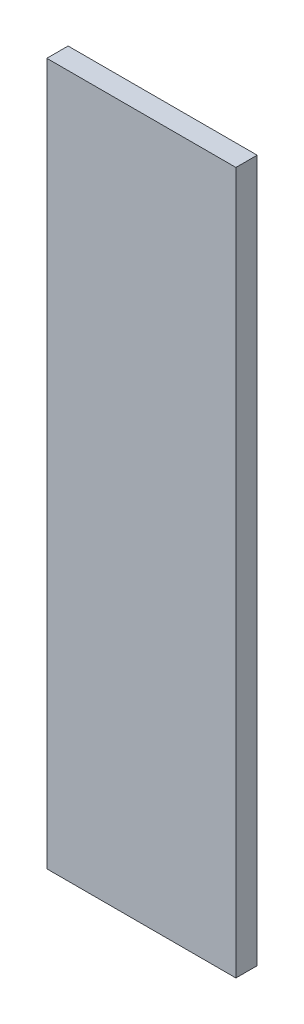
ISO-10303-21;
HEADER;
FILE_DESCRIPTION(('STEP AP214'),'2;1');
FILE_NAME('part.step','',(''),(''),'','','');
FILE_SCHEMA(('AUTOMOTIVE_DESIGN { 1 0 10303 214 1 1 1 1 }'));
ENDSEC;
DATA;
#1=APPLICATION_CONTEXT('core data for automotive mechanical design processes');
#2=APPLICATION_PROTOCOL_DEFINITION('international standard','automotive_design',2000,#1);
#3=PRODUCT_CONTEXT('',#1,'mechanical');
#4=PRODUCT('Part','Part','',(#3));
#5=PRODUCT_RELATED_PRODUCT_CATEGORY('part','',(#4));
#6=PRODUCT_DEFINITION_FORMATION('','',#4);
#7=PRODUCT_DEFINITION_CONTEXT('part definition',#1,'design');
#8=PRODUCT_DEFINITION('design','',#6,#7);
#9=PRODUCT_DEFINITION_SHAPE('','',#8);
#10=(LENGTH_UNIT() NAMED_UNIT(*) SI_UNIT(.MILLI.,.METRE.));
#11=(NAMED_UNIT(*) PLANE_ANGLE_UNIT() SI_UNIT($,.RADIAN.));
#12=(NAMED_UNIT(*) SI_UNIT($,.STERADIAN.) SOLID_ANGLE_UNIT());
#13=UNCERTAINTY_MEASURE_WITH_UNIT(LENGTH_MEASURE(1.E-05),#10,'distance_accuracy_value','');
#14=(GEOMETRIC_REPRESENTATION_CONTEXT(3) GLOBAL_UNCERTAINTY_ASSIGNED_CONTEXT((#13)) GLOBAL_UNIT_ASSIGNED_CONTEXT((#10,
#11,#12)) REPRESENTATION_CONTEXT('',''));
#15=CARTESIAN_POINT('',(0.,0.,0.));
#16=DIRECTION('',(0.,0.,1.));
#17=DIRECTION('',(1.,0.,0.));
#18=AXIS2_PLACEMENT_3D('',#15,#16,#17);
#19=CARTESIAN_POINT('',(-80.,-297.,18.));
#20=DIRECTION('',(1.,0.,0.));
#21=DIRECTION('',(0.,0.,-1.));
#22=AXIS2_PLACEMENT_3D('',#19,#20,#21);
#23=PLANE('',#22);
#24=DIRECTION('',(0.,-1.,0.));
#25=VECTOR('',#24,1.);
#26=CARTESIAN_POINT('',(-80.,-297.,0.));
#27=LINE('',#26,#25);
#28=CARTESIAN_POINT('',(-80.,297.,0.));
#29=VERTEX_POINT('',#28);
#30=CARTESIAN_POINT('',(-80.,-297.,0.));
#31=VERTEX_POINT('',#30);
#32=EDGE_CURVE('E96',#29,#31,#27,.T.);
#33=ORIENTED_EDGE('',*,*,#32,.T.);
#34=DIRECTION('',(0.,0.,-1.));
#35=VECTOR('',#34,1.);
#36=CARTESIAN_POINT('',(-80.,-297.,18.));
#37=LINE('',#36,#35);
#38=CARTESIAN_POINT('',(-80.,-297.,18.));
#39=VERTEX_POINT('',#38);
#40=EDGE_CURVE('E11',#39,#31,#37,.T.);
#41=ORIENTED_EDGE('',*,*,#40,.F.);
#42=DIRECTION('',(0.,-1.,0.));
#43=VECTOR('',#42,1.);
#44=CARTESIAN_POINT('',(-80.,-297.,18.));
#45=LINE('',#44,#43);
#46=CARTESIAN_POINT('',(-80.,297.,18.));
#47=VERTEX_POINT('',#46);
#48=EDGE_CURVE('E84',#47,#39,#45,.T.);
#49=ORIENTED_EDGE('',*,*,#48,.F.);
#50=DIRECTION('',(0.,0.,-1.));
#51=VECTOR('',#50,1.);
#52=CARTESIAN_POINT('',(-80.,297.,18.));
#53=LINE('',#52,#51);
#54=EDGE_CURVE('E92',#47,#29,#53,.T.);
#55=ORIENTED_EDGE('',*,*,#54,.T.);
#56=EDGE_LOOP('',(#33,#41,#49,#55));
#57=FACE_BOUND('',#56,.T.);
#58=ADVANCED_FACE('F33',(#57),#23,.F.);
#59=CARTESIAN_POINT('',(80.,-297.,18.));
#60=DIRECTION('',(0.,1.,0.));
#61=DIRECTION('',(0.,0.,1.));
#62=AXIS2_PLACEMENT_3D('',#59,#60,#61);
#63=PLANE('',#62);
#64=DIRECTION('',(1.,0.,0.));
#65=VECTOR('',#64,1.);
#66=CARTESIAN_POINT('',(80.,-297.,0.));
#67=LINE('',#66,#65);
#68=CARTESIAN_POINT('',(80.,-297.,0.));
#69=VERTEX_POINT('',#68);
#70=EDGE_CURVE('E88',#31,#69,#67,.T.);
#71=ORIENTED_EDGE('',*,*,#70,.T.);
#72=DIRECTION('',(0.,0.,-1.));
#73=VECTOR('',#72,1.);
#74=CARTESIAN_POINT('',(80.,-297.,18.));
#75=LINE('',#74,#73);
#76=CARTESIAN_POINT('',(80.,-297.,18.));
#77=VERTEX_POINT('',#76);
#78=EDGE_CURVE('E41',#77,#69,#75,.T.);
#79=ORIENTED_EDGE('',*,*,#78,.F.);
#80=DIRECTION('',(1.,0.,0.));
#81=VECTOR('',#80,1.);
#82=CARTESIAN_POINT('',(80.,-297.,18.));
#83=LINE('',#82,#81);
#84=EDGE_CURVE('E79',#39,#77,#83,.T.);
#85=ORIENTED_EDGE('',*,*,#84,.F.);
#86=ORIENTED_EDGE('',*,*,#40,.T.);
#87=EDGE_LOOP('',(#71,#79,#85,#86));
#88=FACE_BOUND('',#87,.T.);
#89=ADVANCED_FACE('F87',(#88),#63,.F.);
#90=CARTESIAN_POINT('',(80.,-297.,18.));
#91=DIRECTION('',(-1.,0.,0.));
#92=DIRECTION('',(0.,0.,1.));
#93=AXIS2_PLACEMENT_3D('',#90,#91,#92);
#94=PLANE('',#93);
#95=DIRECTION('',(0.,1.,0.));
#96=VECTOR('',#95,1.);
#97=CARTESIAN_POINT('',(80.,-297.,0.));
#98=LINE('',#97,#96);
#99=CARTESIAN_POINT('',(80.,297.,0.));
#100=VERTEX_POINT('',#99);
#101=EDGE_CURVE('E66',#69,#100,#98,.T.);
#102=ORIENTED_EDGE('',*,*,#101,.T.);
#103=DIRECTION('',(0.,0.,-1.));
#104=VECTOR('',#103,1.);
#105=CARTESIAN_POINT('',(80.,297.,18.));
#106=LINE('',#105,#104);
#107=CARTESIAN_POINT('',(80.,297.,18.));
#108=VERTEX_POINT('',#107);
#109=EDGE_CURVE('E89',#108,#100,#106,.T.);
#110=ORIENTED_EDGE('',*,*,#109,.F.);
#111=DIRECTION('',(0.,1.,0.));
#112=VECTOR('',#111,1.);
#113=CARTESIAN_POINT('',(80.,-297.,18.));
#114=LINE('',#113,#112);
#115=EDGE_CURVE('E82',#77,#108,#114,.T.);
#116=ORIENTED_EDGE('',*,*,#115,.F.);
#117=ORIENTED_EDGE('',*,*,#78,.T.);
#118=EDGE_LOOP('',(#102,#110,#116,#117));
#119=FACE_BOUND('',#118,.T.);
#120=ADVANCED_FACE('F90',(#119),#94,.F.);
#121=CARTESIAN_POINT('',(80.,297.,18.));
#122=DIRECTION('',(0.,-1.,0.));
#123=DIRECTION('',(0.,0.,-1.));
#124=AXIS2_PLACEMENT_3D('',#121,#122,#123);
#125=PLANE('',#124);
#126=DIRECTION('',(-1.,0.,0.));
#127=VECTOR('',#126,1.);
#128=CARTESIAN_POINT('',(80.,297.,0.));
#129=LINE('',#128,#127);
#130=EDGE_CURVE('E72',#100,#29,#129,.T.);
#131=ORIENTED_EDGE('',*,*,#130,.T.);
#132=ORIENTED_EDGE('',*,*,#54,.F.);
#133=DIRECTION('',(-1.,0.,0.));
#134=VECTOR('',#133,1.);
#135=CARTESIAN_POINT('',(80.,297.,18.));
#136=LINE('',#135,#134);
#137=EDGE_CURVE('E49',#108,#47,#136,.T.);
#138=ORIENTED_EDGE('',*,*,#137,.F.);
#139=ORIENTED_EDGE('',*,*,#109,.T.);
#140=EDGE_LOOP('',(#131,#132,#138,#139));
#141=FACE_BOUND('',#140,.T.);
#142=ADVANCED_FACE('F103',(#141),#125,.F.);
#143=CARTESIAN_POINT('',(0.,0.,18.));
#144=DIRECTION('',(0.,0.,1.));
#145=DIRECTION('',(1.,0.,0.));
#146=AXIS2_PLACEMENT_3D('',#143,#144,#145);
#147=PLANE('',#146);
#148=ORIENTED_EDGE('',*,*,#48,.T.);
#149=ORIENTED_EDGE('',*,*,#84,.T.);
#150=ORIENTED_EDGE('',*,*,#115,.T.);
#151=ORIENTED_EDGE('',*,*,#137,.T.);
#152=EDGE_LOOP('',(#148,#149,#150,#151));
#153=FACE_BOUND('',#152,.T.);
#154=ADVANCED_FACE('F80',(#153),#147,.T.);
#155=CARTESIAN_POINT('',(0.,0.,0.));
#156=DIRECTION('',(0.,0.,1.));
#157=DIRECTION('',(1.,0.,0.));
#158=AXIS2_PLACEMENT_3D('',#155,#156,#157);
#159=PLANE('',#158);
#160=ORIENTED_EDGE('',*,*,#32,.F.);
#161=ORIENTED_EDGE('',*,*,#130,.F.);
#162=ORIENTED_EDGE('',*,*,#101,.F.);
#163=ORIENTED_EDGE('',*,*,#70,.F.);
#164=EDGE_LOOP('',(#160,#161,#162,#163));
#165=FACE_BOUND('',#164,.T.);
#166=ADVANCED_FACE('F106',(#165),#159,.F.);
#167=CLOSED_SHELL('',(#58,#89,#120,#142,#154,#166));
#168=MANIFOLD_SOLID_BREP('B2',#167);
#169=ADVANCED_BREP_SHAPE_REPRESENTATION('',(#18,#168),#14);
#170=SHAPE_DEFINITION_REPRESENTATION(#9,#169);
ENDSEC;
END-ISO-10303-21;
